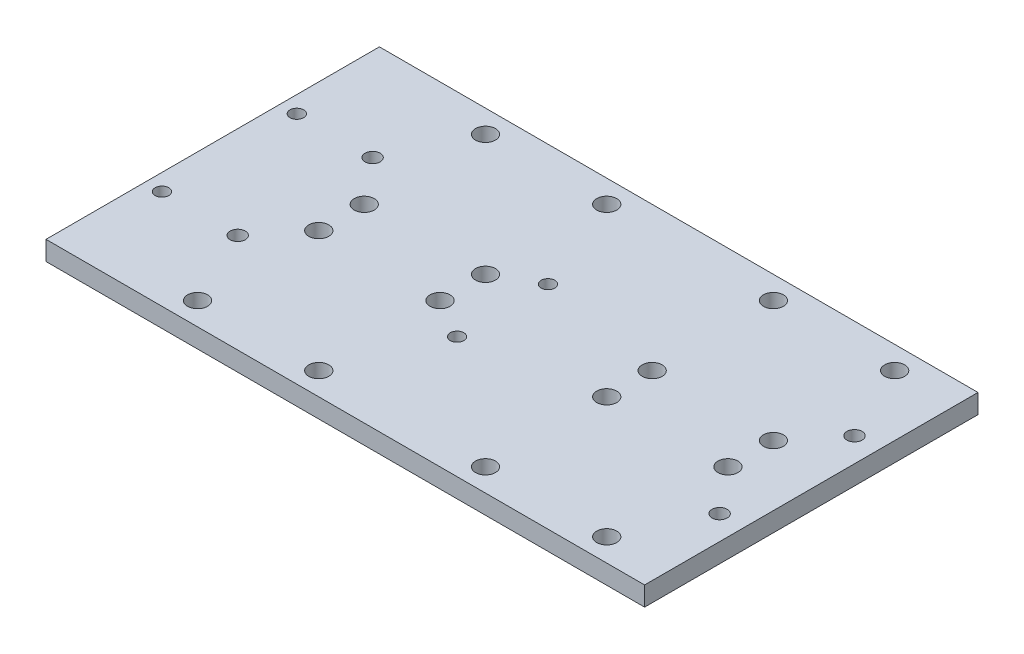
ISO-10303-21;
HEADER;
FILE_DESCRIPTION(('STEP AP214'),'2;1');
FILE_NAME('part.step','',(''),(''),'','','');
FILE_SCHEMA(('AUTOMOTIVE_DESIGN { 1 0 10303 214 1 1 1 1 }'));
ENDSEC;
DATA;
#1=APPLICATION_CONTEXT('core data for automotive mechanical design processes');
#2=APPLICATION_PROTOCOL_DEFINITION('international standard','automotive_design',2000,#1);
#3=PRODUCT_CONTEXT('',#1,'mechanical');
#4=PRODUCT('Part','Part','',(#3));
#5=PRODUCT_RELATED_PRODUCT_CATEGORY('part','',(#4));
#6=PRODUCT_DEFINITION_FORMATION('','',#4);
#7=PRODUCT_DEFINITION_CONTEXT('part definition',#1,'design');
#8=PRODUCT_DEFINITION('design','',#6,#7);
#9=PRODUCT_DEFINITION_SHAPE('','',#8);
#10=(LENGTH_UNIT() NAMED_UNIT(*) SI_UNIT(.MILLI.,.METRE.));
#11=(NAMED_UNIT(*) PLANE_ANGLE_UNIT() SI_UNIT($,.RADIAN.));
#12=(NAMED_UNIT(*) SI_UNIT($,.STERADIAN.) SOLID_ANGLE_UNIT());
#13=UNCERTAINTY_MEASURE_WITH_UNIT(LENGTH_MEASURE(1.E-05),#10,'distance_accuracy_value','');
#14=(GEOMETRIC_REPRESENTATION_CONTEXT(3) GLOBAL_UNCERTAINTY_ASSIGNED_CONTEXT((#13)) GLOBAL_UNIT_ASSIGNED_CONTEXT((#10,
#11,#12)) REPRESENTATION_CONTEXT('',''));
#15=CARTESIAN_POINT('',(0.,0.,0.));
#16=DIRECTION('',(0.,0.,1.));
#17=DIRECTION('',(1.,0.,0.));
#18=AXIS2_PLACEMENT_3D('',#15,#16,#17);
#19=CARTESIAN_POINT('',(-100.,6.35,-55.));
#20=DIRECTION('',(0.,0.,1.));
#21=DIRECTION('',(1.,0.,0.));
#22=AXIS2_PLACEMENT_3D('',#19,#20,#21);
#23=PLANE('',#22);
#24=DIRECTION('',(-1.,0.,0.));
#25=VECTOR('',#24,1.);
#26=CARTESIAN_POINT('',(-100.,6.35,-55.));
#27=LINE('',#26,#25);
#28=CARTESIAN_POINT('',(87.5,6.35,-55.));
#29=VERTEX_POINT('',#28);
#30=CARTESIAN_POINT('',(-110.,6.35,-55.));
#31=VERTEX_POINT('',#30);
#32=EDGE_CURVE('E46',#29,#31,#27,.T.);
#33=ORIENTED_EDGE('',*,*,#32,.F.);
#34=DIRECTION('',(0.,1.,0.));
#35=VECTOR('',#34,1.);
#36=CARTESIAN_POINT('',(87.5,0.,-55.));
#37=LINE('',#36,#35);
#38=CARTESIAN_POINT('',(87.5,0.,-55.));
#39=VERTEX_POINT('',#38);
#40=EDGE_CURVE('E290',#39,#29,#37,.T.);
#41=ORIENTED_EDGE('',*,*,#40,.F.);
#42=DIRECTION('',(-1.,0.,0.));
#43=VECTOR('',#42,1.);
#44=CARTESIAN_POINT('',(-100.,0.,-55.));
#45=LINE('',#44,#43);
#46=CARTESIAN_POINT('',(-110.,0.,-55.));
#47=VERTEX_POINT('',#46);
#48=EDGE_CURVE('E181',#39,#47,#45,.T.);
#49=ORIENTED_EDGE('',*,*,#48,.T.);
#50=DIRECTION('',(0.,1.,0.));
#51=VECTOR('',#50,1.);
#52=CARTESIAN_POINT('',(-110.,0.,-55.));
#53=LINE('',#52,#51);
#54=EDGE_CURVE('E89',#47,#31,#53,.T.);
#55=ORIENTED_EDGE('',*,*,#54,.T.);
#56=EDGE_LOOP('',(#33,#41,#49,#55));
#57=FACE_BOUND('',#56,.T.);
#58=ADVANCED_FACE('F38',(#57),#23,.F.);
#59=CARTESIAN_POINT('',(-100.,6.35,55.));
#60=DIRECTION('',(0.,0.,-1.));
#61=DIRECTION('',(-1.,0.,0.));
#62=AXIS2_PLACEMENT_3D('',#59,#60,#61);
#63=PLANE('',#62);
#64=DIRECTION('',(1.,0.,0.));
#65=VECTOR('',#64,1.);
#66=CARTESIAN_POINT('',(-100.,0.,55.));
#67=LINE('',#66,#65);
#68=CARTESIAN_POINT('',(-110.,0.,55.));
#69=VERTEX_POINT('',#68);
#70=CARTESIAN_POINT('',(87.5,0.,55.));
#71=VERTEX_POINT('',#70);
#72=EDGE_CURVE('E62',#69,#71,#67,.T.);
#73=ORIENTED_EDGE('',*,*,#72,.T.);
#74=DIRECTION('',(0.,1.,0.));
#75=VECTOR('',#74,1.);
#76=CARTESIAN_POINT('',(87.5,0.,55.));
#77=LINE('',#76,#75);
#78=CARTESIAN_POINT('',(87.5,6.35,55.));
#79=VERTEX_POINT('',#78);
#80=EDGE_CURVE('E54',#71,#79,#77,.T.);
#81=ORIENTED_EDGE('',*,*,#80,.T.);
#82=DIRECTION('',(1.,0.,0.));
#83=VECTOR('',#82,1.);
#84=CARTESIAN_POINT('',(-100.,6.35,55.));
#85=LINE('',#84,#83);
#86=CARTESIAN_POINT('',(-110.,6.35,55.));
#87=VERTEX_POINT('',#86);
#88=EDGE_CURVE('E11',#87,#79,#85,.T.);
#89=ORIENTED_EDGE('',*,*,#88,.F.);
#90=DIRECTION('',(0.,1.,0.));
#91=VECTOR('',#90,1.);
#92=CARTESIAN_POINT('',(-110.,0.,55.));
#93=LINE('',#92,#91);
#94=EDGE_CURVE('E76',#69,#87,#93,.T.);
#95=ORIENTED_EDGE('',*,*,#94,.F.);
#96=EDGE_LOOP('',(#73,#81,#89,#95));
#97=FACE_BOUND('',#96,.T.);
#98=ADVANCED_FACE('F75',(#97),#63,.F.);
#99=CARTESIAN_POINT('',(0.,6.35,0.));
#100=DIRECTION('',(0.,-1.,0.));
#101=DIRECTION('',(0.,0.,-1.));
#102=AXIS2_PLACEMENT_3D('',#99,#100,#101);
#103=PLANE('',#102);
#104=CARTESIAN_POINT('',(-14.375,6.35,-15.));
#105=DIRECTION('',(0.,1.,0.));
#106=DIRECTION('',(0.,0.,1.));
#107=AXIS2_PLACEMENT_3D('',#104,#105,#106);
#108=CIRCLE('',#107,2.25);
#109=CARTESIAN_POINT('',(-14.375,6.35,-12.75));
#110=VERTEX_POINT('',#109);
#111=EDGE_CURVE('E301',#110,#110,#108,.T.);
#112=ORIENTED_EDGE('',*,*,#111,.F.);
#113=EDGE_LOOP('',(#112));
#114=FACE_BOUND('',#113,.T.);
#115=CARTESIAN_POINT('',(-14.375,6.35,15.));
#116=DIRECTION('',(0.,1.,0.));
#117=DIRECTION('',(0.,0.,1.));
#118=AXIS2_PLACEMENT_3D('',#115,#116,#117);
#119=CIRCLE('',#118,2.25);
#120=CARTESIAN_POINT('',(-14.375,6.35,17.25));
#121=VERTEX_POINT('',#120);
#122=EDGE_CURVE('E308',#121,#121,#119,.T.);
#123=ORIENTED_EDGE('',*,*,#122,.F.);
#124=EDGE_LOOP('',(#123));
#125=FACE_BOUND('',#124,.T.);
#126=CARTESIAN_POINT('',(-104.5,6.35,-22.25));
#127=DIRECTION('',(0.,1.,0.));
#128=DIRECTION('',(0.,0.,1.));
#129=AXIS2_PLACEMENT_3D('',#126,#127,#128);
#130=CIRCLE('',#129,2.25);
#131=CARTESIAN_POINT('',(-104.5,6.35,-20.));
#132=VERTEX_POINT('',#131);
#133=EDGE_CURVE('E311',#132,#132,#130,.T.);
#134=ORIENTED_EDGE('',*,*,#133,.F.);
#135=EDGE_LOOP('',(#134));
#136=FACE_BOUND('',#135,.T.);
#137=CARTESIAN_POINT('',(-104.5,6.35,22.25));
#138=DIRECTION('',(0.,1.,0.));
#139=DIRECTION('',(0.,0.,1.));
#140=AXIS2_PLACEMENT_3D('',#137,#138,#139);
#141=CIRCLE('',#140,2.25);
#142=CARTESIAN_POINT('',(-104.5,6.35,24.5));
#143=VERTEX_POINT('',#142);
#144=EDGE_CURVE('E222',#143,#143,#141,.T.);
#145=ORIENTED_EDGE('',*,*,#144,.F.);
#146=EDGE_LOOP('',(#145));
#147=FACE_BOUND('',#146,.T.);
#148=CARTESIAN_POINT('',(-79.5,6.35,-22.25));
#149=DIRECTION('',(0.,1.,0.));
#150=DIRECTION('',(0.,0.,1.));
#151=AXIS2_PLACEMENT_3D('',#148,#149,#150);
#152=CIRCLE('',#151,2.5);
#153=CARTESIAN_POINT('',(-79.5,6.35,-19.75));
#154=VERTEX_POINT('',#153);
#155=EDGE_CURVE('E211',#154,#154,#152,.T.);
#156=ORIENTED_EDGE('',*,*,#155,.F.);
#157=EDGE_LOOP('',(#156));
#158=FACE_BOUND('',#157,.T.);
#159=CARTESIAN_POINT('',(-79.5,6.35,22.25));
#160=DIRECTION('',(0.,1.,0.));
#161=DIRECTION('',(0.,0.,1.));
#162=AXIS2_PLACEMENT_3D('',#159,#160,#161);
#163=CIRCLE('',#162,2.5);
#164=CARTESIAN_POINT('',(-79.5,6.35,24.75));
#165=VERTEX_POINT('',#164);
#166=EDGE_CURVE('E208',#165,#165,#163,.T.);
#167=ORIENTED_EDGE('',*,*,#166,.F.);
#168=EDGE_LOOP('',(#167));
#169=FACE_BOUND('',#168,.T.);
#170=CARTESIAN_POINT('',(79.5,6.35,22.25));
#171=DIRECTION('',(0.,1.,0.));
#172=DIRECTION('',(0.,0.,1.));
#173=AXIS2_PLACEMENT_3D('',#170,#171,#172);
#174=CIRCLE('',#173,2.5);
#175=CARTESIAN_POINT('',(79.5,6.35,24.75));
#176=VERTEX_POINT('',#175);
#177=EDGE_CURVE('E205',#176,#176,#174,.T.);
#178=ORIENTED_EDGE('',*,*,#177,.F.);
#179=EDGE_LOOP('',(#178));
#180=FACE_BOUND('',#179,.T.);
#181=CARTESIAN_POINT('',(79.5,6.35,-22.25));
#182=DIRECTION('',(0.,1.,0.));
#183=DIRECTION('',(0.,0.,1.));
#184=AXIS2_PLACEMENT_3D('',#181,#182,#183);
#185=CIRCLE('',#184,2.5);
#186=CARTESIAN_POINT('',(79.5,6.35,-19.75));
#187=VERTEX_POINT('',#186);
#188=EDGE_CURVE('E98',#187,#187,#185,.T.);
#189=ORIENTED_EDGE('',*,*,#188,.F.);
#190=EDGE_LOOP('',(#189));
#191=FACE_BOUND('',#190,.T.);
#192=CARTESIAN_POINT('',(-67.5,6.35,-47.5));
#193=DIRECTION('',(0.,1.,0.));
#194=DIRECTION('',(0.,0.,1.));
#195=AXIS2_PLACEMENT_3D('',#192,#193,#194);
#196=CIRCLE('',#195,3.3);
#197=CARTESIAN_POINT('',(-67.5,6.35,-44.2));
#198=VERTEX_POINT('',#197);
#199=EDGE_CURVE('E88',#198,#198,#196,.T.);
#200=ORIENTED_EDGE('',*,*,#199,.F.);
#201=EDGE_LOOP('',(#200));
#202=FACE_BOUND('',#201,.T.);
#203=CARTESIAN_POINT('',(-27.5,6.35,-47.5));
#204=DIRECTION('',(0.,1.,0.));
#205=DIRECTION('',(0.,0.,1.));
#206=AXIS2_PLACEMENT_3D('',#203,#204,#205);
#207=CIRCLE('',#206,3.3);
#208=CARTESIAN_POINT('',(-27.5,6.35,-44.2));
#209=VERTEX_POINT('',#208);
#210=EDGE_CURVE('E108',#209,#209,#207,.T.);
#211=ORIENTED_EDGE('',*,*,#210,.F.);
#212=EDGE_LOOP('',(#211));
#213=FACE_BOUND('',#212,.T.);
#214=CARTESIAN_POINT('',(-27.5,6.35,-7.50000000000003));
#215=DIRECTION('',(0.,1.,0.));
#216=DIRECTION('',(0.,0.,1.));
#217=AXIS2_PLACEMENT_3D('',#214,#215,#216);
#218=CIRCLE('',#217,3.3);
#219=CARTESIAN_POINT('',(-27.5,6.35,-4.20000000000003));
#220=VERTEX_POINT('',#219);
#221=EDGE_CURVE('E114',#220,#220,#218,.T.);
#222=ORIENTED_EDGE('',*,*,#221,.F.);
#223=EDGE_LOOP('',(#222));
#224=FACE_BOUND('',#223,.T.);
#225=CARTESIAN_POINT('',(-67.5,6.35,-7.50000000000001));
#226=DIRECTION('',(0.,1.,0.));
#227=DIRECTION('',(0.,0.,1.));
#228=AXIS2_PLACEMENT_3D('',#225,#226,#227);
#229=CIRCLE('',#228,3.3);
#230=CARTESIAN_POINT('',(-67.5,6.35,-4.20000000000002));
#231=VERTEX_POINT('',#230);
#232=EDGE_CURVE('E120',#231,#231,#229,.T.);
#233=ORIENTED_EDGE('',*,*,#232,.F.);
#234=EDGE_LOOP('',(#233));
#235=FACE_BOUND('',#234,.T.);
#236=CARTESIAN_POINT('',(-67.5,6.35,7.50000000000003));
#237=DIRECTION('',(0.,1.,0.));
#238=DIRECTION('',(0.,0.,1.));
#239=AXIS2_PLACEMENT_3D('',#236,#237,#238);
#240=CIRCLE('',#239,3.3);
#241=CARTESIAN_POINT('',(-67.5,6.35,10.8));
#242=VERTEX_POINT('',#241);
#243=EDGE_CURVE('E126',#242,#242,#240,.T.);
#244=ORIENTED_EDGE('',*,*,#243,.F.);
#245=EDGE_LOOP('',(#244));
#246=FACE_BOUND('',#245,.T.);
#247=CARTESIAN_POINT('',(-27.5,6.35,7.50000000000003));
#248=DIRECTION('',(0.,1.,0.));
#249=DIRECTION('',(0.,0.,1.));
#250=AXIS2_PLACEMENT_3D('',#247,#248,#249);
#251=CIRCLE('',#250,3.3);
#252=CARTESIAN_POINT('',(-27.5,6.35,10.8));
#253=VERTEX_POINT('',#252);
#254=EDGE_CURVE('E130',#253,#253,#251,.T.);
#255=ORIENTED_EDGE('',*,*,#254,.F.);
#256=EDGE_LOOP('',(#255));
#257=FACE_BOUND('',#256,.T.);
#258=CARTESIAN_POINT('',(-27.5,6.35,47.5));
#259=DIRECTION('',(0.,1.,0.));
#260=DIRECTION('',(0.,0.,1.));
#261=AXIS2_PLACEMENT_3D('',#258,#259,#260);
#262=CIRCLE('',#261,3.3);
#263=CARTESIAN_POINT('',(-27.5,6.35,50.8));
#264=VERTEX_POINT('',#263);
#265=EDGE_CURVE('E134',#264,#264,#262,.T.);
#266=ORIENTED_EDGE('',*,*,#265,.F.);
#267=EDGE_LOOP('',(#266));
#268=FACE_BOUND('',#267,.T.);
#269=CARTESIAN_POINT('',(-67.5,6.35,47.5));
#270=DIRECTION('',(0.,1.,0.));
#271=DIRECTION('',(0.,0.,1.));
#272=AXIS2_PLACEMENT_3D('',#269,#270,#271);
#273=CIRCLE('',#272,3.3);
#274=CARTESIAN_POINT('',(-67.5,6.35,50.8));
#275=VERTEX_POINT('',#274);
#276=EDGE_CURVE('E138',#275,#275,#273,.T.);
#277=ORIENTED_EDGE('',*,*,#276,.F.);
#278=EDGE_LOOP('',(#277));
#279=FACE_BOUND('',#278,.T.);
#280=CARTESIAN_POINT('',(27.5,6.35,47.5));
#281=DIRECTION('',(0.,1.,0.));
#282=DIRECTION('',(0.,0.,1.));
#283=AXIS2_PLACEMENT_3D('',#280,#281,#282);
#284=CIRCLE('',#283,3.3);
#285=CARTESIAN_POINT('',(27.5,6.35,50.8));
#286=VERTEX_POINT('',#285);
#287=EDGE_CURVE('E142',#286,#286,#284,.T.);
#288=ORIENTED_EDGE('',*,*,#287,.F.);
#289=EDGE_LOOP('',(#288));
#290=FACE_BOUND('',#289,.T.);
#291=CARTESIAN_POINT('',(27.5,6.35,7.50000000000003));
#292=DIRECTION('',(0.,1.,0.));
#293=DIRECTION('',(0.,0.,1.));
#294=AXIS2_PLACEMENT_3D('',#291,#292,#293);
#295=CIRCLE('',#294,3.3);
#296=CARTESIAN_POINT('',(27.5,6.35,10.8));
#297=VERTEX_POINT('',#296);
#298=EDGE_CURVE('E148',#297,#297,#295,.T.);
#299=ORIENTED_EDGE('',*,*,#298,.F.);
#300=EDGE_LOOP('',(#299));
#301=FACE_BOUND('',#300,.T.);
#302=CARTESIAN_POINT('',(27.5,6.35,-7.50000000000003));
#303=DIRECTION('',(0.,1.,0.));
#304=DIRECTION('',(0.,0.,1.));
#305=AXIS2_PLACEMENT_3D('',#302,#303,#304);
#306=CIRCLE('',#305,3.3);
#307=CARTESIAN_POINT('',(27.5,6.35,-4.20000000000003));
#308=VERTEX_POINT('',#307);
#309=EDGE_CURVE('E152',#308,#308,#306,.T.);
#310=ORIENTED_EDGE('',*,*,#309,.F.);
#311=EDGE_LOOP('',(#310));
#312=FACE_BOUND('',#311,.T.);
#313=CARTESIAN_POINT('',(27.5,6.35,-47.5));
#314=DIRECTION('',(0.,1.,0.));
#315=DIRECTION('',(0.,0.,1.));
#316=AXIS2_PLACEMENT_3D('',#313,#314,#315);
#317=CIRCLE('',#316,3.3);
#318=CARTESIAN_POINT('',(27.5,6.35,-44.2));
#319=VERTEX_POINT('',#318);
#320=EDGE_CURVE('E158',#319,#319,#317,.T.);
#321=ORIENTED_EDGE('',*,*,#320,.F.);
#322=EDGE_LOOP('',(#321));
#323=FACE_BOUND('',#322,.T.);
#324=CARTESIAN_POINT('',(67.5,6.35,-47.5));
#325=DIRECTION('',(0.,1.,0.));
#326=DIRECTION('',(0.,0.,1.));
#327=AXIS2_PLACEMENT_3D('',#324,#325,#326);
#328=CIRCLE('',#327,3.3);
#329=CARTESIAN_POINT('',(67.5,6.35,-44.2));
#330=VERTEX_POINT('',#329);
#331=EDGE_CURVE('E164',#330,#330,#328,.T.);
#332=ORIENTED_EDGE('',*,*,#331,.F.);
#333=EDGE_LOOP('',(#332));
#334=FACE_BOUND('',#333,.T.);
#335=CARTESIAN_POINT('',(67.5,6.35,-7.50000000000001));
#336=DIRECTION('',(0.,1.,0.));
#337=DIRECTION('',(0.,0.,1.));
#338=AXIS2_PLACEMENT_3D('',#335,#336,#337);
#339=CIRCLE('',#338,3.3);
#340=CARTESIAN_POINT('',(67.5,6.35,-4.20000000000002));
#341=VERTEX_POINT('',#340);
#342=EDGE_CURVE('E168',#341,#341,#339,.T.);
#343=ORIENTED_EDGE('',*,*,#342,.F.);
#344=EDGE_LOOP('',(#343));
#345=FACE_BOUND('',#344,.T.);
#346=CARTESIAN_POINT('',(67.5,6.35,7.50000000000003));
#347=DIRECTION('',(0.,1.,0.));
#348=DIRECTION('',(0.,0.,1.));
#349=AXIS2_PLACEMENT_3D('',#346,#347,#348);
#350=CIRCLE('',#349,3.3);
#351=CARTESIAN_POINT('',(67.5,6.35,10.8));
#352=VERTEX_POINT('',#351);
#353=EDGE_CURVE('E172',#352,#352,#350,.T.);
#354=ORIENTED_EDGE('',*,*,#353,.F.);
#355=EDGE_LOOP('',(#354));
#356=FACE_BOUND('',#355,.T.);
#357=CARTESIAN_POINT('',(67.5,6.35,47.5));
#358=DIRECTION('',(0.,1.,0.));
#359=DIRECTION('',(0.,0.,1.));
#360=AXIS2_PLACEMENT_3D('',#357,#358,#359);
#361=CIRCLE('',#360,3.3);
#362=CARTESIAN_POINT('',(67.5,6.35,50.8));
#363=VERTEX_POINT('',#362);
#364=EDGE_CURVE('E176',#363,#363,#361,.T.);
#365=ORIENTED_EDGE('',*,*,#364,.F.);
#366=EDGE_LOOP('',(#365));
#367=FACE_BOUND('',#366,.T.);
#368=ORIENTED_EDGE('',*,*,#88,.T.);
#369=DIRECTION('',(0.,0.,1.));
#370=VECTOR('',#369,1.);
#371=CARTESIAN_POINT('',(87.5,6.35,-55.));
#372=LINE('',#371,#370);
#373=EDGE_CURVE('E296',#29,#79,#372,.T.);
#374=ORIENTED_EDGE('',*,*,#373,.F.);
#375=ORIENTED_EDGE('',*,*,#32,.T.);
#376=DIRECTION('',(0.,0.,1.));
#377=VECTOR('',#376,1.);
#378=CARTESIAN_POINT('',(-110.,6.35,-55.));
#379=LINE('',#378,#377);
#380=EDGE_CURVE('E86',#31,#87,#379,.T.);
#381=ORIENTED_EDGE('',*,*,#380,.T.);
#382=EDGE_LOOP('',(#368,#374,#375,#381));
#383=FACE_BOUND('',#382,.T.);
#384=ADVANCED_FACE('F91',(#114,#125,#136,#147,#158,#169,#180,#191,#202,#213,#224,#235,#246,#257,
#268,#279,#290,#301,#312,#323,#334,#345,#356,#367,#383),#103,.F.);
#385=CARTESIAN_POINT('',(0.,0.,0.));
#386=DIRECTION('',(0.,-1.,0.));
#387=DIRECTION('',(0.,0.,-1.));
#388=AXIS2_PLACEMENT_3D('',#385,#386,#387);
#389=PLANE('',#388);
#390=DIRECTION('',(0.,0.,1.));
#391=VECTOR('',#390,1.);
#392=CARTESIAN_POINT('',(87.5,0.,-55.));
#393=LINE('',#392,#391);
#394=EDGE_CURVE('E294',#39,#71,#393,.T.);
#395=ORIENTED_EDGE('',*,*,#394,.T.);
#396=ORIENTED_EDGE('',*,*,#72,.F.);
#397=DIRECTION('',(0.,0.,1.));
#398=VECTOR('',#397,1.);
#399=CARTESIAN_POINT('',(-110.,0.,-55.));
#400=LINE('',#399,#398);
#401=EDGE_CURVE('E87',#47,#69,#400,.T.);
#402=ORIENTED_EDGE('',*,*,#401,.F.);
#403=ORIENTED_EDGE('',*,*,#48,.F.);
#404=EDGE_LOOP('',(#395,#396,#402,#403));
#405=FACE_BOUND('',#404,.T.);
#406=CARTESIAN_POINT('',(-14.375,0.,-15.));
#407=DIRECTION('',(0.,-1.,0.));
#408=DIRECTION('',(0.,0.,-1.));
#409=AXIS2_PLACEMENT_3D('',#406,#407,#408);
#410=CIRCLE('',#409,2.25);
#411=CARTESIAN_POINT('',(-14.375,0.,-17.25));
#412=VERTEX_POINT('',#411);
#413=EDGE_CURVE('E305',#412,#412,#410,.T.);
#414=ORIENTED_EDGE('',*,*,#413,.F.);
#415=EDGE_LOOP('',(#414));
#416=FACE_BOUND('',#415,.T.);
#417=CARTESIAN_POINT('',(-14.375,0.,15.));
#418=DIRECTION('',(0.,-1.,0.));
#419=DIRECTION('',(0.,0.,-1.));
#420=AXIS2_PLACEMENT_3D('',#417,#418,#419);
#421=CIRCLE('',#420,2.25);
#422=CARTESIAN_POINT('',(-14.375,0.,12.75));
#423=VERTEX_POINT('',#422);
#424=EDGE_CURVE('E41',#423,#423,#421,.T.);
#425=ORIENTED_EDGE('',*,*,#424,.F.);
#426=EDGE_LOOP('',(#425));
#427=FACE_BOUND('',#426,.T.);
#428=CARTESIAN_POINT('',(-104.5,0.,-22.25));
#429=DIRECTION('',(0.,-1.,0.));
#430=DIRECTION('',(0.,0.,-1.));
#431=AXIS2_PLACEMENT_3D('',#428,#429,#430);
#432=CIRCLE('',#431,2.25);
#433=CARTESIAN_POINT('',(-104.5,0.,-24.5));
#434=VERTEX_POINT('',#433);
#435=EDGE_CURVE('E314',#434,#434,#432,.T.);
#436=ORIENTED_EDGE('',*,*,#435,.F.);
#437=EDGE_LOOP('',(#436));
#438=FACE_BOUND('',#437,.T.);
#439=CARTESIAN_POINT('',(-104.5,0.,22.25));
#440=DIRECTION('',(0.,-1.,0.));
#441=DIRECTION('',(0.,0.,-1.));
#442=AXIS2_PLACEMENT_3D('',#439,#440,#441);
#443=CIRCLE('',#442,2.25);
#444=CARTESIAN_POINT('',(-104.5,0.,20.));
#445=VERTEX_POINT('',#444);
#446=EDGE_CURVE('E217',#445,#445,#443,.T.);
#447=ORIENTED_EDGE('',*,*,#446,.F.);
#448=EDGE_LOOP('',(#447));
#449=FACE_BOUND('',#448,.T.);
#450=CARTESIAN_POINT('',(-79.5,0.,-22.25));
#451=DIRECTION('',(0.,-1.,0.));
#452=DIRECTION('',(0.,0.,-1.));
#453=AXIS2_PLACEMENT_3D('',#450,#451,#452);
#454=CIRCLE('',#453,2.5);
#455=CARTESIAN_POINT('',(-79.5,0.,-24.75));
#456=VERTEX_POINT('',#455);
#457=EDGE_CURVE('E209',#456,#456,#454,.T.);
#458=ORIENTED_EDGE('',*,*,#457,.F.);
#459=EDGE_LOOP('',(#458));
#460=FACE_BOUND('',#459,.T.);
#461=CARTESIAN_POINT('',(-79.5,0.,22.25));
#462=DIRECTION('',(0.,-1.,0.));
#463=DIRECTION('',(0.,0.,-1.));
#464=AXIS2_PLACEMENT_3D('',#461,#462,#463);
#465=CIRCLE('',#464,2.5);
#466=CARTESIAN_POINT('',(-79.5,0.,19.75));
#467=VERTEX_POINT('',#466);
#468=EDGE_CURVE('E206',#467,#467,#465,.T.);
#469=ORIENTED_EDGE('',*,*,#468,.F.);
#470=EDGE_LOOP('',(#469));
#471=FACE_BOUND('',#470,.T.);
#472=CARTESIAN_POINT('',(79.5,0.,22.25));
#473=DIRECTION('',(0.,-1.,0.));
#474=DIRECTION('',(0.,0.,-1.));
#475=AXIS2_PLACEMENT_3D('',#472,#473,#474);
#476=CIRCLE('',#475,2.5);
#477=CARTESIAN_POINT('',(79.5,0.,19.75));
#478=VERTEX_POINT('',#477);
#479=EDGE_CURVE('E202',#478,#478,#476,.T.);
#480=ORIENTED_EDGE('',*,*,#479,.F.);
#481=EDGE_LOOP('',(#480));
#482=FACE_BOUND('',#481,.T.);
#483=CARTESIAN_POINT('',(79.5,0.,-22.25));
#484=DIRECTION('',(0.,-1.,0.));
#485=DIRECTION('',(0.,0.,-1.));
#486=AXIS2_PLACEMENT_3D('',#483,#484,#485);
#487=CIRCLE('',#486,2.5);
#488=CARTESIAN_POINT('',(79.5,0.,-24.75));
#489=VERTEX_POINT('',#488);
#490=EDGE_CURVE('E94',#489,#489,#487,.T.);
#491=ORIENTED_EDGE('',*,*,#490,.F.);
#492=EDGE_LOOP('',(#491));
#493=FACE_BOUND('',#492,.T.);
#494=CARTESIAN_POINT('',(-67.5,0.,-47.5));
#495=DIRECTION('',(0.,-1.,0.));
#496=DIRECTION('',(0.,0.,-1.));
#497=AXIS2_PLACEMENT_3D('',#494,#495,#496);
#498=CIRCLE('',#497,3.3);
#499=CARTESIAN_POINT('',(-67.5,0.,-50.8));
#500=VERTEX_POINT('',#499);
#501=EDGE_CURVE('E105',#500,#500,#498,.T.);
#502=ORIENTED_EDGE('',*,*,#501,.F.);
#503=EDGE_LOOP('',(#502));
#504=FACE_BOUND('',#503,.T.);
#505=CARTESIAN_POINT('',(-27.5,0.,-47.5));
#506=DIRECTION('',(0.,-1.,0.));
#507=DIRECTION('',(0.,0.,-1.));
#508=AXIS2_PLACEMENT_3D('',#505,#506,#507);
#509=CIRCLE('',#508,3.3);
#510=CARTESIAN_POINT('',(-27.5,0.,-50.8));
#511=VERTEX_POINT('',#510);
#512=EDGE_CURVE('E111',#511,#511,#509,.T.);
#513=ORIENTED_EDGE('',*,*,#512,.F.);
#514=EDGE_LOOP('',(#513));
#515=FACE_BOUND('',#514,.T.);
#516=CARTESIAN_POINT('',(-27.5,0.,-7.50000000000003));
#517=DIRECTION('',(0.,-1.,0.));
#518=DIRECTION('',(0.,0.,-1.));
#519=AXIS2_PLACEMENT_3D('',#516,#517,#518);
#520=CIRCLE('',#519,3.3);
#521=CARTESIAN_POINT('',(-27.5,0.,-10.8));
#522=VERTEX_POINT('',#521);
#523=EDGE_CURVE('E117',#522,#522,#520,.T.);
#524=ORIENTED_EDGE('',*,*,#523,.F.);
#525=EDGE_LOOP('',(#524));
#526=FACE_BOUND('',#525,.T.);
#527=CARTESIAN_POINT('',(-67.5,0.,-7.50000000000001));
#528=DIRECTION('',(0.,-1.,0.));
#529=DIRECTION('',(0.,0.,-1.));
#530=AXIS2_PLACEMENT_3D('',#527,#528,#529);
#531=CIRCLE('',#530,3.3);
#532=CARTESIAN_POINT('',(-67.5,0.,-10.8));
#533=VERTEX_POINT('',#532);
#534=EDGE_CURVE('E123',#533,#533,#531,.T.);
#535=ORIENTED_EDGE('',*,*,#534,.F.);
#536=EDGE_LOOP('',(#535));
#537=FACE_BOUND('',#536,.T.);
#538=CARTESIAN_POINT('',(-67.5,0.,7.50000000000003));
#539=DIRECTION('',(0.,-1.,0.));
#540=DIRECTION('',(0.,0.,-1.));
#541=AXIS2_PLACEMENT_3D('',#538,#539,#540);
#542=CIRCLE('',#541,3.3);
#543=CARTESIAN_POINT('',(-67.5,0.,4.20000000000003));
#544=VERTEX_POINT('',#543);
#545=EDGE_CURVE('E129',#544,#544,#542,.T.);
#546=ORIENTED_EDGE('',*,*,#545,.F.);
#547=EDGE_LOOP('',(#546));
#548=FACE_BOUND('',#547,.T.);
#549=CARTESIAN_POINT('',(-27.5,0.,7.50000000000003));
#550=DIRECTION('',(0.,-1.,0.));
#551=DIRECTION('',(0.,0.,-1.));
#552=AXIS2_PLACEMENT_3D('',#549,#550,#551);
#553=CIRCLE('',#552,3.3);
#554=CARTESIAN_POINT('',(-27.5,0.,4.20000000000004));
#555=VERTEX_POINT('',#554);
#556=EDGE_CURVE('E133',#555,#555,#553,.T.);
#557=ORIENTED_EDGE('',*,*,#556,.F.);
#558=EDGE_LOOP('',(#557));
#559=FACE_BOUND('',#558,.T.);
#560=CARTESIAN_POINT('',(-27.5,0.,47.5));
#561=DIRECTION('',(0.,-1.,0.));
#562=DIRECTION('',(0.,0.,-1.));
#563=AXIS2_PLACEMENT_3D('',#560,#561,#562);
#564=CIRCLE('',#563,3.3);
#565=CARTESIAN_POINT('',(-27.5,0.,44.2));
#566=VERTEX_POINT('',#565);
#567=EDGE_CURVE('E137',#566,#566,#564,.T.);
#568=ORIENTED_EDGE('',*,*,#567,.F.);
#569=EDGE_LOOP('',(#568));
#570=FACE_BOUND('',#569,.T.);
#571=CARTESIAN_POINT('',(-67.5,0.,47.5));
#572=DIRECTION('',(0.,-1.,0.));
#573=DIRECTION('',(0.,0.,-1.));
#574=AXIS2_PLACEMENT_3D('',#571,#572,#573);
#575=CIRCLE('',#574,3.3);
#576=CARTESIAN_POINT('',(-67.5,0.,44.2));
#577=VERTEX_POINT('',#576);
#578=EDGE_CURVE('E141',#577,#577,#575,.T.);
#579=ORIENTED_EDGE('',*,*,#578,.F.);
#580=EDGE_LOOP('',(#579));
#581=FACE_BOUND('',#580,.T.);
#582=CARTESIAN_POINT('',(27.5,0.,47.5));
#583=DIRECTION('',(0.,-1.,0.));
#584=DIRECTION('',(0.,0.,-1.));
#585=AXIS2_PLACEMENT_3D('',#582,#583,#584);
#586=CIRCLE('',#585,3.3);
#587=CARTESIAN_POINT('',(27.5,0.,44.2));
#588=VERTEX_POINT('',#587);
#589=EDGE_CURVE('E145',#588,#588,#586,.T.);
#590=ORIENTED_EDGE('',*,*,#589,.F.);
#591=EDGE_LOOP('',(#590));
#592=FACE_BOUND('',#591,.T.);
#593=CARTESIAN_POINT('',(27.5,0.,7.50000000000003));
#594=DIRECTION('',(0.,-1.,0.));
#595=DIRECTION('',(0.,0.,-1.));
#596=AXIS2_PLACEMENT_3D('',#593,#594,#595);
#597=CIRCLE('',#596,3.3);
#598=CARTESIAN_POINT('',(27.5,0.,4.20000000000004));
#599=VERTEX_POINT('',#598);
#600=EDGE_CURVE('E151',#599,#599,#597,.T.);
#601=ORIENTED_EDGE('',*,*,#600,.F.);
#602=EDGE_LOOP('',(#601));
#603=FACE_BOUND('',#602,.T.);
#604=CARTESIAN_POINT('',(27.5,0.,-7.50000000000003));
#605=DIRECTION('',(0.,-1.,0.));
#606=DIRECTION('',(0.,0.,-1.));
#607=AXIS2_PLACEMENT_3D('',#604,#605,#606);
#608=CIRCLE('',#607,3.3);
#609=CARTESIAN_POINT('',(27.5,0.,-10.8));
#610=VERTEX_POINT('',#609);
#611=EDGE_CURVE('E155',#610,#610,#608,.T.);
#612=ORIENTED_EDGE('',*,*,#611,.F.);
#613=EDGE_LOOP('',(#612));
#614=FACE_BOUND('',#613,.T.);
#615=CARTESIAN_POINT('',(27.5,0.,-47.5));
#616=DIRECTION('',(0.,-1.,0.));
#617=DIRECTION('',(0.,0.,-1.));
#618=AXIS2_PLACEMENT_3D('',#615,#616,#617);
#619=CIRCLE('',#618,3.3);
#620=CARTESIAN_POINT('',(27.5,0.,-50.8));
#621=VERTEX_POINT('',#620);
#622=EDGE_CURVE('E161',#621,#621,#619,.T.);
#623=ORIENTED_EDGE('',*,*,#622,.F.);
#624=EDGE_LOOP('',(#623));
#625=FACE_BOUND('',#624,.T.);
#626=CARTESIAN_POINT('',(67.5,0.,-47.5));
#627=DIRECTION('',(0.,-1.,0.));
#628=DIRECTION('',(0.,0.,-1.));
#629=AXIS2_PLACEMENT_3D('',#626,#627,#628);
#630=CIRCLE('',#629,3.3);
#631=CARTESIAN_POINT('',(67.5,0.,-50.8));
#632=VERTEX_POINT('',#631);
#633=EDGE_CURVE('E167',#632,#632,#630,.T.);
#634=ORIENTED_EDGE('',*,*,#633,.F.);
#635=EDGE_LOOP('',(#634));
#636=FACE_BOUND('',#635,.T.);
#637=CARTESIAN_POINT('',(67.5,0.,-7.50000000000001));
#638=DIRECTION('',(0.,-1.,0.));
#639=DIRECTION('',(0.,0.,-1.));
#640=AXIS2_PLACEMENT_3D('',#637,#638,#639);
#641=CIRCLE('',#640,3.3);
#642=CARTESIAN_POINT('',(67.5,0.,-10.8));
#643=VERTEX_POINT('',#642);
#644=EDGE_CURVE('E171',#643,#643,#641,.T.);
#645=ORIENTED_EDGE('',*,*,#644,.F.);
#646=EDGE_LOOP('',(#645));
#647=FACE_BOUND('',#646,.T.);
#648=CARTESIAN_POINT('',(67.5,0.,7.50000000000003));
#649=DIRECTION('',(0.,-1.,0.));
#650=DIRECTION('',(0.,0.,-1.));
#651=AXIS2_PLACEMENT_3D('',#648,#649,#650);
#652=CIRCLE('',#651,3.3);
#653=CARTESIAN_POINT('',(67.5,0.,4.20000000000003));
#654=VERTEX_POINT('',#653);
#655=EDGE_CURVE('E175',#654,#654,#652,.T.);
#656=ORIENTED_EDGE('',*,*,#655,.F.);
#657=EDGE_LOOP('',(#656));
#658=FACE_BOUND('',#657,.T.);
#659=CARTESIAN_POINT('',(67.5,0.,47.5));
#660=DIRECTION('',(0.,-1.,0.));
#661=DIRECTION('',(0.,0.,-1.));
#662=AXIS2_PLACEMENT_3D('',#659,#660,#661);
#663=CIRCLE('',#662,3.3);
#664=CARTESIAN_POINT('',(67.5,0.,44.2));
#665=VERTEX_POINT('',#664);
#666=EDGE_CURVE('E179',#665,#665,#663,.T.);
#667=ORIENTED_EDGE('',*,*,#666,.F.);
#668=EDGE_LOOP('',(#667));
#669=FACE_BOUND('',#668,.T.);
#670=ADVANCED_FACE('F234',(#405,#416,#427,#438,#449,#460,#471,#482,#493,#504,#515,#526,#537,
#548,#559,#570,#581,#592,#603,#614,#625,#636,#647,#658,#669),#389,.T.);
#671=CARTESIAN_POINT('',(67.5,6.35,47.5));
#672=DIRECTION('',(0.,1.,0.));
#673=DIRECTION('',(0.,0.,1.));
#674=AXIS2_PLACEMENT_3D('',#671,#672,#673);
#675=CYLINDRICAL_SURFACE('',#674,3.3);
#676=ORIENTED_EDGE('',*,*,#666,.T.);
#677=EDGE_LOOP('',(#676));
#678=FACE_BOUND('',#677,.T.);
#679=ORIENTED_EDGE('',*,*,#364,.T.);
#680=EDGE_LOOP('',(#679));
#681=FACE_BOUND('',#680,.T.);
#682=ADVANCED_FACE('F269',(#678,#681),#675,.F.);
#683=CARTESIAN_POINT('',(67.5,6.35,7.50000000000003));
#684=DIRECTION('',(0.,1.,0.));
#685=DIRECTION('',(0.,0.,1.));
#686=AXIS2_PLACEMENT_3D('',#683,#684,#685);
#687=CYLINDRICAL_SURFACE('',#686,3.3);
#688=ORIENTED_EDGE('',*,*,#655,.T.);
#689=EDGE_LOOP('',(#688));
#690=FACE_BOUND('',#689,.T.);
#691=ORIENTED_EDGE('',*,*,#353,.T.);
#692=EDGE_LOOP('',(#691));
#693=FACE_BOUND('',#692,.T.);
#694=ADVANCED_FACE('F271',(#690,#693),#687,.F.);
#695=CARTESIAN_POINT('',(67.5,6.35,-7.50000000000001));
#696=DIRECTION('',(0.,1.,0.));
#697=DIRECTION('',(0.,0.,1.));
#698=AXIS2_PLACEMENT_3D('',#695,#696,#697);
#699=CYLINDRICAL_SURFACE('',#698,3.3);
#700=ORIENTED_EDGE('',*,*,#644,.T.);
#701=EDGE_LOOP('',(#700));
#702=FACE_BOUND('',#701,.T.);
#703=ORIENTED_EDGE('',*,*,#342,.T.);
#704=EDGE_LOOP('',(#703));
#705=FACE_BOUND('',#704,.T.);
#706=ADVANCED_FACE('F278',(#702,#705),#699,.F.);
#707=CARTESIAN_POINT('',(67.5,6.35,-47.5));
#708=DIRECTION('',(0.,1.,0.));
#709=DIRECTION('',(0.,0.,1.));
#710=AXIS2_PLACEMENT_3D('',#707,#708,#709);
#711=CYLINDRICAL_SURFACE('',#710,3.3);
#712=ORIENTED_EDGE('',*,*,#633,.T.);
#713=EDGE_LOOP('',(#712));
#714=FACE_BOUND('',#713,.T.);
#715=ORIENTED_EDGE('',*,*,#331,.T.);
#716=EDGE_LOOP('',(#715));
#717=FACE_BOUND('',#716,.T.);
#718=ADVANCED_FACE('F392',(#714,#717),#711,.F.);
#719=CARTESIAN_POINT('',(27.5,6.35,-47.5));
#720=DIRECTION('',(0.,1.,0.));
#721=DIRECTION('',(0.,0.,1.));
#722=AXIS2_PLACEMENT_3D('',#719,#720,#721);
#723=CYLINDRICAL_SURFACE('',#722,3.3);
#724=ORIENTED_EDGE('',*,*,#622,.T.);
#725=EDGE_LOOP('',(#724));
#726=FACE_BOUND('',#725,.T.);
#727=ORIENTED_EDGE('',*,*,#320,.T.);
#728=EDGE_LOOP('',(#727));
#729=FACE_BOUND('',#728,.T.);
#730=ADVANCED_FACE('F388',(#726,#729),#723,.F.);
#731=CARTESIAN_POINT('',(27.5,6.35,-7.50000000000003));
#732=DIRECTION('',(0.,1.,0.));
#733=DIRECTION('',(0.,0.,1.));
#734=AXIS2_PLACEMENT_3D('',#731,#732,#733);
#735=CYLINDRICAL_SURFACE('',#734,3.3);
#736=ORIENTED_EDGE('',*,*,#611,.T.);
#737=EDGE_LOOP('',(#736));
#738=FACE_BOUND('',#737,.T.);
#739=ORIENTED_EDGE('',*,*,#309,.T.);
#740=EDGE_LOOP('',(#739));
#741=FACE_BOUND('',#740,.T.);
#742=ADVANCED_FACE('F384',(#738,#741),#735,.F.);
#743=CARTESIAN_POINT('',(27.5,6.35,7.50000000000003));
#744=DIRECTION('',(0.,1.,0.));
#745=DIRECTION('',(0.,0.,1.));
#746=AXIS2_PLACEMENT_3D('',#743,#744,#745);
#747=CYLINDRICAL_SURFACE('',#746,3.3);
#748=ORIENTED_EDGE('',*,*,#600,.T.);
#749=EDGE_LOOP('',(#748));
#750=FACE_BOUND('',#749,.T.);
#751=ORIENTED_EDGE('',*,*,#298,.T.);
#752=EDGE_LOOP('',(#751));
#753=FACE_BOUND('',#752,.T.);
#754=ADVANCED_FACE('F380',(#750,#753),#747,.F.);
#755=CARTESIAN_POINT('',(27.5,6.35,47.5));
#756=DIRECTION('',(0.,1.,0.));
#757=DIRECTION('',(0.,0.,1.));
#758=AXIS2_PLACEMENT_3D('',#755,#756,#757);
#759=CYLINDRICAL_SURFACE('',#758,3.3);
#760=ORIENTED_EDGE('',*,*,#589,.T.);
#761=EDGE_LOOP('',(#760));
#762=FACE_BOUND('',#761,.T.);
#763=ORIENTED_EDGE('',*,*,#287,.T.);
#764=EDGE_LOOP('',(#763));
#765=FACE_BOUND('',#764,.T.);
#766=ADVANCED_FACE('F376',(#762,#765),#759,.F.);
#767=CARTESIAN_POINT('',(-67.5,6.35,47.5));
#768=DIRECTION('',(0.,1.,0.));
#769=DIRECTION('',(0.,0.,1.));
#770=AXIS2_PLACEMENT_3D('',#767,#768,#769);
#771=CYLINDRICAL_SURFACE('',#770,3.3);
#772=ORIENTED_EDGE('',*,*,#578,.T.);
#773=EDGE_LOOP('',(#772));
#774=FACE_BOUND('',#773,.T.);
#775=ORIENTED_EDGE('',*,*,#276,.T.);
#776=EDGE_LOOP('',(#775));
#777=FACE_BOUND('',#776,.T.);
#778=ADVANCED_FACE('F372',(#774,#777),#771,.F.);
#779=CARTESIAN_POINT('',(-27.5,6.35,47.5));
#780=DIRECTION('',(0.,1.,0.));
#781=DIRECTION('',(0.,0.,1.));
#782=AXIS2_PLACEMENT_3D('',#779,#780,#781);
#783=CYLINDRICAL_SURFACE('',#782,3.3);
#784=ORIENTED_EDGE('',*,*,#567,.T.);
#785=EDGE_LOOP('',(#784));
#786=FACE_BOUND('',#785,.T.);
#787=ORIENTED_EDGE('',*,*,#265,.T.);
#788=EDGE_LOOP('',(#787));
#789=FACE_BOUND('',#788,.T.);
#790=ADVANCED_FACE('F368',(#786,#789),#783,.F.);
#791=CARTESIAN_POINT('',(-27.5,6.35,7.50000000000003));
#792=DIRECTION('',(0.,1.,0.));
#793=DIRECTION('',(0.,0.,1.));
#794=AXIS2_PLACEMENT_3D('',#791,#792,#793);
#795=CYLINDRICAL_SURFACE('',#794,3.3);
#796=ORIENTED_EDGE('',*,*,#556,.T.);
#797=EDGE_LOOP('',(#796));
#798=FACE_BOUND('',#797,.T.);
#799=ORIENTED_EDGE('',*,*,#254,.T.);
#800=EDGE_LOOP('',(#799));
#801=FACE_BOUND('',#800,.T.);
#802=ADVANCED_FACE('F364',(#798,#801),#795,.F.);
#803=CARTESIAN_POINT('',(-67.5,6.35,7.50000000000003));
#804=DIRECTION('',(0.,1.,0.));
#805=DIRECTION('',(0.,0.,1.));
#806=AXIS2_PLACEMENT_3D('',#803,#804,#805);
#807=CYLINDRICAL_SURFACE('',#806,3.3);
#808=ORIENTED_EDGE('',*,*,#545,.T.);
#809=EDGE_LOOP('',(#808));
#810=FACE_BOUND('',#809,.T.);
#811=ORIENTED_EDGE('',*,*,#243,.T.);
#812=EDGE_LOOP('',(#811));
#813=FACE_BOUND('',#812,.T.);
#814=ADVANCED_FACE('F360',(#810,#813),#807,.F.);
#815=CARTESIAN_POINT('',(-67.5,6.35,-7.50000000000001));
#816=DIRECTION('',(0.,1.,0.));
#817=DIRECTION('',(0.,0.,1.));
#818=AXIS2_PLACEMENT_3D('',#815,#816,#817);
#819=CYLINDRICAL_SURFACE('',#818,3.3);
#820=ORIENTED_EDGE('',*,*,#534,.T.);
#821=EDGE_LOOP('',(#820));
#822=FACE_BOUND('',#821,.T.);
#823=ORIENTED_EDGE('',*,*,#232,.T.);
#824=EDGE_LOOP('',(#823));
#825=FACE_BOUND('',#824,.T.);
#826=ADVANCED_FACE('F356',(#822,#825),#819,.F.);
#827=CARTESIAN_POINT('',(-27.5,6.35,-7.50000000000003));
#828=DIRECTION('',(0.,1.,0.));
#829=DIRECTION('',(0.,0.,1.));
#830=AXIS2_PLACEMENT_3D('',#827,#828,#829);
#831=CYLINDRICAL_SURFACE('',#830,3.3);
#832=ORIENTED_EDGE('',*,*,#523,.T.);
#833=EDGE_LOOP('',(#832));
#834=FACE_BOUND('',#833,.T.);
#835=ORIENTED_EDGE('',*,*,#221,.T.);
#836=EDGE_LOOP('',(#835));
#837=FACE_BOUND('',#836,.T.);
#838=ADVANCED_FACE('F352',(#834,#837),#831,.F.);
#839=CARTESIAN_POINT('',(-27.5,6.35,-47.5));
#840=DIRECTION('',(0.,1.,0.));
#841=DIRECTION('',(0.,0.,1.));
#842=AXIS2_PLACEMENT_3D('',#839,#840,#841);
#843=CYLINDRICAL_SURFACE('',#842,3.3);
#844=ORIENTED_EDGE('',*,*,#512,.T.);
#845=EDGE_LOOP('',(#844));
#846=FACE_BOUND('',#845,.T.);
#847=ORIENTED_EDGE('',*,*,#210,.T.);
#848=EDGE_LOOP('',(#847));
#849=FACE_BOUND('',#848,.T.);
#850=ADVANCED_FACE('F348',(#846,#849),#843,.F.);
#851=CARTESIAN_POINT('',(-67.5,6.35,-47.5));
#852=DIRECTION('',(0.,1.,0.));
#853=DIRECTION('',(0.,0.,1.));
#854=AXIS2_PLACEMENT_3D('',#851,#852,#853);
#855=CYLINDRICAL_SURFACE('',#854,3.3);
#856=ORIENTED_EDGE('',*,*,#501,.T.);
#857=EDGE_LOOP('',(#856));
#858=FACE_BOUND('',#857,.T.);
#859=ORIENTED_EDGE('',*,*,#199,.T.);
#860=EDGE_LOOP('',(#859));
#861=FACE_BOUND('',#860,.T.);
#862=ADVANCED_FACE('F345',(#858,#861),#855,.F.);
#863=CARTESIAN_POINT('',(-110.,0.,-55.));
#864=DIRECTION('',(-1.,0.,0.));
#865=DIRECTION('',(0.,0.,1.));
#866=AXIS2_PLACEMENT_3D('',#863,#864,#865);
#867=PLANE('',#866);
#868=ORIENTED_EDGE('',*,*,#380,.F.);
#869=ORIENTED_EDGE('',*,*,#54,.F.);
#870=ORIENTED_EDGE('',*,*,#401,.T.);
#871=ORIENTED_EDGE('',*,*,#94,.T.);
#872=EDGE_LOOP('',(#868,#869,#870,#871));
#873=FACE_BOUND('',#872,.T.);
#874=ADVANCED_FACE('F84',(#873),#867,.T.);
#875=CARTESIAN_POINT('',(79.5,6.35,-22.25));
#876=DIRECTION('',(0.,1.,0.));
#877=DIRECTION('',(0.,0.,1.));
#878=AXIS2_PLACEMENT_3D('',#875,#876,#877);
#879=CYLINDRICAL_SURFACE('',#878,2.5);
#880=ORIENTED_EDGE('',*,*,#490,.T.);
#881=EDGE_LOOP('',(#880));
#882=FACE_BOUND('',#881,.T.);
#883=ORIENTED_EDGE('',*,*,#188,.T.);
#884=EDGE_LOOP('',(#883));
#885=FACE_BOUND('',#884,.T.);
#886=ADVANCED_FACE('F230',(#882,#885),#879,.F.);
#887=CARTESIAN_POINT('',(79.5,6.35,22.25));
#888=DIRECTION('',(0.,1.,0.));
#889=DIRECTION('',(0.,0.,1.));
#890=AXIS2_PLACEMENT_3D('',#887,#888,#889);
#891=CYLINDRICAL_SURFACE('',#890,2.5);
#892=ORIENTED_EDGE('',*,*,#479,.T.);
#893=EDGE_LOOP('',(#892));
#894=FACE_BOUND('',#893,.T.);
#895=ORIENTED_EDGE('',*,*,#177,.T.);
#896=EDGE_LOOP('',(#895));
#897=FACE_BOUND('',#896,.T.);
#898=ADVANCED_FACE('F327',(#894,#897),#891,.F.);
#899=CARTESIAN_POINT('',(-79.5,6.35,22.25));
#900=DIRECTION('',(0.,1.,0.));
#901=DIRECTION('',(0.,0.,1.));
#902=AXIS2_PLACEMENT_3D('',#899,#900,#901);
#903=CYLINDRICAL_SURFACE('',#902,2.5);
#904=ORIENTED_EDGE('',*,*,#468,.T.);
#905=EDGE_LOOP('',(#904));
#906=FACE_BOUND('',#905,.T.);
#907=ORIENTED_EDGE('',*,*,#166,.T.);
#908=EDGE_LOOP('',(#907));
#909=FACE_BOUND('',#908,.T.);
#910=ADVANCED_FACE('F329',(#906,#909),#903,.F.);
#911=CARTESIAN_POINT('',(-79.5,6.35,-22.25));
#912=DIRECTION('',(0.,1.,0.));
#913=DIRECTION('',(0.,0.,1.));
#914=AXIS2_PLACEMENT_3D('',#911,#912,#913);
#915=CYLINDRICAL_SURFACE('',#914,2.5);
#916=ORIENTED_EDGE('',*,*,#457,.T.);
#917=EDGE_LOOP('',(#916));
#918=FACE_BOUND('',#917,.T.);
#919=ORIENTED_EDGE('',*,*,#155,.T.);
#920=EDGE_LOOP('',(#919));
#921=FACE_BOUND('',#920,.T.);
#922=ADVANCED_FACE('F336',(#918,#921),#915,.F.);
#923=CARTESIAN_POINT('',(-104.5,6.35,22.25));
#924=DIRECTION('',(0.,1.,0.));
#925=DIRECTION('',(0.,0.,1.));
#926=AXIS2_PLACEMENT_3D('',#923,#924,#925);
#927=CYLINDRICAL_SURFACE('',#926,2.25);
#928=ORIENTED_EDGE('',*,*,#446,.T.);
#929=EDGE_LOOP('',(#928));
#930=FACE_BOUND('',#929,.T.);
#931=ORIENTED_EDGE('',*,*,#144,.T.);
#932=EDGE_LOOP('',(#931));
#933=FACE_BOUND('',#932,.T.);
#934=ADVANCED_FACE('F319',(#930,#933),#927,.F.);
#935=CARTESIAN_POINT('',(-104.5,6.35,-22.25));
#936=DIRECTION('',(0.,1.,0.));
#937=DIRECTION('',(0.,0.,1.));
#938=AXIS2_PLACEMENT_3D('',#935,#936,#937);
#939=CYLINDRICAL_SURFACE('',#938,2.25);
#940=ORIENTED_EDGE('',*,*,#435,.T.);
#941=EDGE_LOOP('',(#940));
#942=FACE_BOUND('',#941,.T.);
#943=ORIENTED_EDGE('',*,*,#133,.T.);
#944=EDGE_LOOP('',(#943));
#945=FACE_BOUND('',#944,.T.);
#946=ADVANCED_FACE('F496',(#942,#945),#939,.F.);
#947=CARTESIAN_POINT('',(-14.375,6.35,15.));
#948=DIRECTION('',(0.,1.,0.));
#949=DIRECTION('',(0.,0.,1.));
#950=AXIS2_PLACEMENT_3D('',#947,#948,#949);
#951=CYLINDRICAL_SURFACE('',#950,2.25);
#952=ORIENTED_EDGE('',*,*,#424,.T.);
#953=EDGE_LOOP('',(#952));
#954=FACE_BOUND('',#953,.T.);
#955=ORIENTED_EDGE('',*,*,#122,.T.);
#956=EDGE_LOOP('',(#955));
#957=FACE_BOUND('',#956,.T.);
#958=ADVANCED_FACE('F504',(#954,#957),#951,.F.);
#959=CARTESIAN_POINT('',(-14.375,6.35,-15.));
#960=DIRECTION('',(0.,1.,0.));
#961=DIRECTION('',(0.,0.,1.));
#962=AXIS2_PLACEMENT_3D('',#959,#960,#961);
#963=CYLINDRICAL_SURFACE('',#962,2.25);
#964=ORIENTED_EDGE('',*,*,#413,.T.);
#965=EDGE_LOOP('',(#964));
#966=FACE_BOUND('',#965,.T.);
#967=ORIENTED_EDGE('',*,*,#111,.T.);
#968=EDGE_LOOP('',(#967));
#969=FACE_BOUND('',#968,.T.);
#970=ADVANCED_FACE('F512',(#966,#969),#963,.F.);
#971=CARTESIAN_POINT('',(87.5,0.,-55.));
#972=DIRECTION('',(-1.,0.,0.));
#973=DIRECTION('',(0.,0.,1.));
#974=AXIS2_PLACEMENT_3D('',#971,#972,#973);
#975=PLANE('',#974);
#976=ORIENTED_EDGE('',*,*,#373,.T.);
#977=ORIENTED_EDGE('',*,*,#80,.F.);
#978=ORIENTED_EDGE('',*,*,#394,.F.);
#979=ORIENTED_EDGE('',*,*,#40,.T.);
#980=EDGE_LOOP('',(#976,#977,#978,#979));
#981=FACE_BOUND('',#980,.T.);
#982=ADVANCED_FACE('F295',(#981),#975,.F.);
#983=CLOSED_SHELL('',(#58,#98,#384,#670,#682,#694,#706,#718,#730,#742,#754,#766,#778,#790,#802,
#814,#826,#838,#850,#862,#874,#886,#898,#910,#922,#934,#946,#958,#970,#982));
#984=MANIFOLD_SOLID_BREP('B2',#983);
#985=ADVANCED_BREP_SHAPE_REPRESENTATION('',(#18,#984),#14);
#986=SHAPE_DEFINITION_REPRESENTATION(#9,#985);
ENDSEC;
END-ISO-10303-21;
